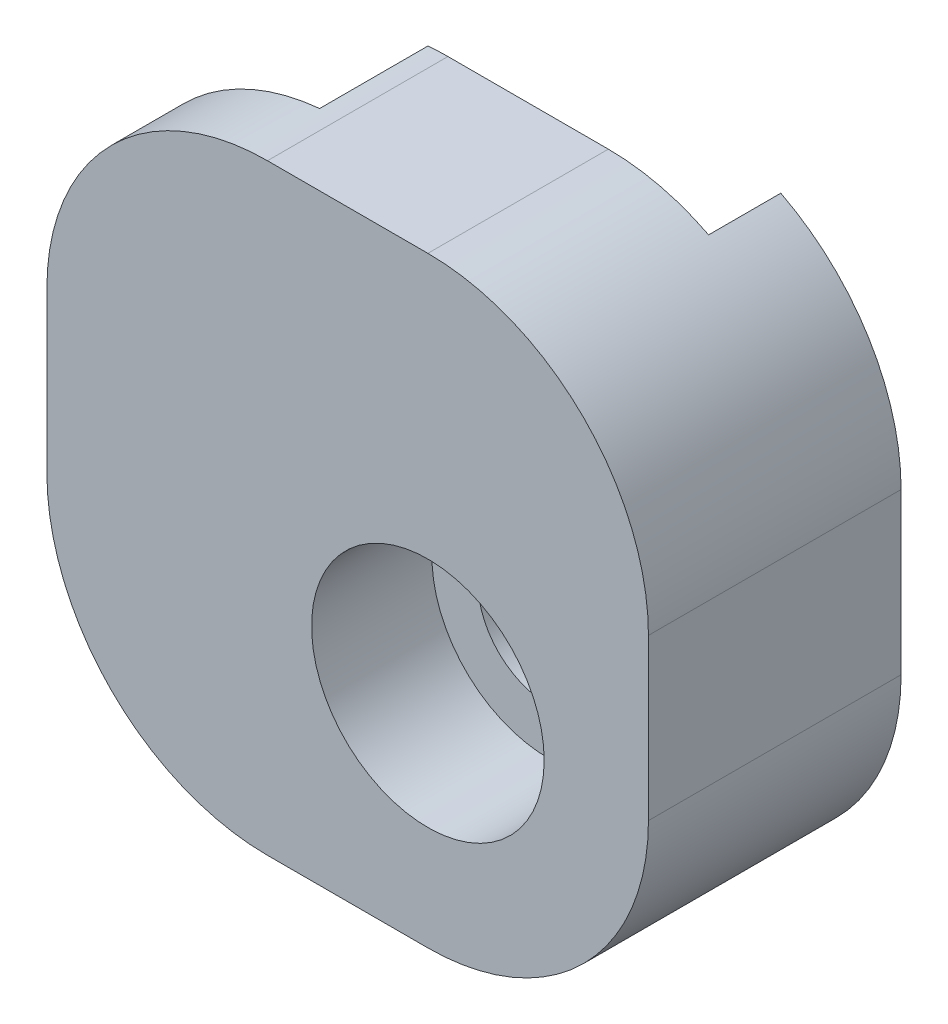
ISO-10303-21;
HEADER;
FILE_DESCRIPTION(('STEP AP214'),'2;1');
FILE_NAME('part.step','',(''),(''),'','','');
FILE_SCHEMA(('AUTOMOTIVE_DESIGN { 1 0 10303 214 1 1 1 1 }'));
ENDSEC;
DATA;
#1=APPLICATION_CONTEXT('core data for automotive mechanical design processes');
#2=APPLICATION_PROTOCOL_DEFINITION('international standard','automotive_design',2000,#1);
#3=PRODUCT_CONTEXT('',#1,'mechanical');
#4=PRODUCT('Part','Part','',(#3));
#5=PRODUCT_RELATED_PRODUCT_CATEGORY('part','',(#4));
#6=PRODUCT_DEFINITION_FORMATION('','',#4);
#7=PRODUCT_DEFINITION_CONTEXT('part definition',#1,'design');
#8=PRODUCT_DEFINITION('design','',#6,#7);
#9=PRODUCT_DEFINITION_SHAPE('','',#8);
#10=(LENGTH_UNIT() NAMED_UNIT(*) SI_UNIT(.MILLI.,.METRE.));
#11=(NAMED_UNIT(*) PLANE_ANGLE_UNIT() SI_UNIT($,.RADIAN.));
#12=(NAMED_UNIT(*) SI_UNIT($,.STERADIAN.) SOLID_ANGLE_UNIT());
#13=UNCERTAINTY_MEASURE_WITH_UNIT(LENGTH_MEASURE(1.E-05),#10,'distance_accuracy_value','');
#14=(GEOMETRIC_REPRESENTATION_CONTEXT(3) GLOBAL_UNCERTAINTY_ASSIGNED_CONTEXT((#13)) GLOBAL_UNIT_ASSIGNED_CONTEXT((#10,
#11,#12)) REPRESENTATION_CONTEXT('',''));
#15=CARTESIAN_POINT('',(0.,0.,0.));
#16=DIRECTION('',(0.,0.,1.));
#17=DIRECTION('',(1.,0.,0.));
#18=AXIS2_PLACEMENT_3D('',#15,#16,#17);
#19=CARTESIAN_POINT('',(-2.5,2.5,2.7));
#20=DIRECTION('',(0.,0.,-1.));
#21=DIRECTION('',(-1.,0.,0.));
#22=AXIS2_PLACEMENT_3D('',#19,#20,#21);
#23=CYLINDRICAL_SURFACE('',#22,1.75);
#24=CARTESIAN_POINT('',(-2.5,2.5,0.));
#25=DIRECTION('',(0.,0.,1.));
#26=DIRECTION('',(1.,0.,0.));
#27=AXIS2_PLACEMENT_3D('',#24,#25,#26);
#28=CIRCLE('',#27,1.75);
#29=CARTESIAN_POINT('',(-0.75,2.5,0.));
#30=VERTEX_POINT('',#29);
#31=EDGE_CURVE('E157',#30,#30,#28,.T.);
#32=ORIENTED_EDGE('',*,*,#31,.F.);
#33=EDGE_LOOP('',(#32));
#34=FACE_BOUND('',#33,.T.);
#35=CARTESIAN_POINT('',(-2.5,2.5,1.5));
#36=DIRECTION('',(0.,0.,1.));
#37=DIRECTION('',(1.,0.,0.));
#38=AXIS2_PLACEMENT_3D('',#35,#36,#37);
#39=CIRCLE('',#38,1.75);
#40=CARTESIAN_POINT('',(-0.75,2.5,1.5));
#41=VERTEX_POINT('',#40);
#42=EDGE_CURVE('E40',#41,#41,#39,.T.);
#43=ORIENTED_EDGE('',*,*,#42,.T.);
#44=EDGE_LOOP('',(#43));
#45=FACE_BOUND('',#44,.T.);
#46=ADVANCED_FACE('F36',(#34,#45),#23,.F.);
#47=CARTESIAN_POINT('',(-12.,0.,0.));
#48=DIRECTION('',(-1.,0.,0.));
#49=DIRECTION('',(0.,0.,1.));
#50=AXIS2_PLACEMENT_3D('',#47,#48,#49);
#51=PLANE('',#50);
#52=DIRECTION('',(0.,0.,1.));
#53=VECTOR('',#52,1.);
#54=CARTESIAN_POINT('',(-12.,2.5,-9.27817459305202));
#55=LINE('',#54,#53);
#56=CARTESIAN_POINT('',(-12.,2.5,2.7));
#57=VERTEX_POINT('',#56);
#58=CARTESIAN_POINT('',(-12.,2.5,4.5));
#59=VERTEX_POINT('',#58);
#60=EDGE_CURVE('E139',#57,#59,#55,.T.);
#61=ORIENTED_EDGE('',*,*,#60,.T.);
#62=DIRECTION('',(0.,-1.,0.));
#63=VECTOR('',#62,1.);
#64=CARTESIAN_POINT('',(-12.,6.5,4.5));
#65=LINE('',#64,#63);
#66=CARTESIAN_POINT('',(-12.,6.5,4.5));
#67=VERTEX_POINT('',#66);
#68=EDGE_CURVE('E52',#67,#59,#65,.T.);
#69=ORIENTED_EDGE('',*,*,#68,.F.);
#70=DIRECTION('',(0.,0.,1.));
#71=VECTOR('',#70,1.);
#72=CARTESIAN_POINT('',(-12.,6.5,-9.27817459305208));
#73=LINE('',#72,#71);
#74=CARTESIAN_POINT('',(-12.,6.5,2.7));
#75=VERTEX_POINT('',#74);
#76=EDGE_CURVE('E11',#67,#75,#73,.F.);
#77=ORIENTED_EDGE('',*,*,#76,.T.);
#78=DIRECTION('',(0.,-1.,0.));
#79=VECTOR('',#78,1.);
#80=CARTESIAN_POINT('',(-12.,12.,2.7));
#81=LINE('',#80,#79);
#82=EDGE_CURVE('E154',#75,#57,#81,.T.);
#83=ORIENTED_EDGE('',*,*,#82,.T.);
#84=EDGE_LOOP('',(#61,#69,#77,#83));
#85=FACE_BOUND('',#84,.T.);
#86=ADVANCED_FACE('F138',(#85),#51,.T.);
#87=CARTESIAN_POINT('',(0.,12.,2.7));
#88=DIRECTION('',(0.,-1.,0.));
#89=DIRECTION('',(0.,0.,-1.));
#90=AXIS2_PLACEMENT_3D('',#87,#88,#89);
#91=PLANE('',#90);
#92=DIRECTION('',(-1.,0.,0.));
#93=VECTOR('',#92,1.);
#94=CARTESIAN_POINT('',(-2.50000000000004,12.,4.5));
#95=LINE('',#94,#93);
#96=CARTESIAN_POINT('',(-2.50000000000004,12.,4.5));
#97=VERTEX_POINT('',#96);
#98=CARTESIAN_POINT('',(-6.5,12.,4.5));
#99=VERTEX_POINT('',#98);
#100=EDGE_CURVE('E133',#97,#99,#95,.T.);
#101=ORIENTED_EDGE('',*,*,#100,.F.);
#102=DIRECTION('',(0.,0.,1.));
#103=VECTOR('',#102,1.);
#104=CARTESIAN_POINT('',(-2.50000000000004,12.,-9.27817459305208));
#105=LINE('',#104,#103);
#106=CARTESIAN_POINT('',(-2.50000000000004,12.,0.));
#107=VERTEX_POINT('',#106);
#108=EDGE_CURVE('E233',#107,#97,#105,.T.);
#109=ORIENTED_EDGE('',*,*,#108,.F.);
#110=DIRECTION('',(-1.,0.,0.));
#111=VECTOR('',#110,1.);
#112=CARTESIAN_POINT('',(0.,12.,0.));
#113=LINE('',#112,#111);
#114=CARTESIAN_POINT('',(-6.5,12.,0.));
#115=VERTEX_POINT('',#114);
#116=EDGE_CURVE('E161',#107,#115,#113,.T.);
#117=ORIENTED_EDGE('',*,*,#116,.T.);
#118=DIRECTION('',(0.,0.,1.));
#119=VECTOR('',#118,1.);
#120=CARTESIAN_POINT('',(-6.5,12.,-9.27817459305208));
#121=LINE('',#120,#119);
#122=EDGE_CURVE('E230',#115,#99,#121,.T.);
#123=ORIENTED_EDGE('',*,*,#122,.T.);
#124=EDGE_LOOP('',(#101,#109,#117,#123));
#125=FACE_BOUND('',#124,.T.);
#126=ADVANCED_FACE('F271',(#125),#91,.F.);
#127=CARTESIAN_POINT('',(0.,-3.,0.));
#128=DIRECTION('',(0.,-1.,0.));
#129=DIRECTION('',(1.,0.,0.));
#130=AXIS2_PLACEMENT_3D('',#127,#128,#129);
#131=PLANE('',#130);
#132=DIRECTION('',(0.,0.,-1.));
#133=VECTOR('',#132,1.);
#134=CARTESIAN_POINT('',(-2.5,-3.,0.));
#135=LINE('',#134,#133);
#136=CARTESIAN_POINT('',(-2.5,-3.,-1.8));
#137=VERTEX_POINT('',#136);
#138=CARTESIAN_POINT('',(-2.5,-3.,4.5));
#139=VERTEX_POINT('',#138);
#140=EDGE_CURVE('E45',#137,#139,#135,.F.);
#141=ORIENTED_EDGE('',*,*,#140,.T.);
#142=DIRECTION('',(1.,0.,0.));
#143=VECTOR('',#142,1.);
#144=CARTESIAN_POINT('',(-6.5,-3.,4.5));
#145=LINE('',#144,#143);
#146=CARTESIAN_POINT('',(-6.5,-3.,4.5));
#147=VERTEX_POINT('',#146);
#148=EDGE_CURVE('E179',#147,#139,#145,.T.);
#149=ORIENTED_EDGE('',*,*,#148,.F.);
#150=DIRECTION('',(0.,0.,1.));
#151=VECTOR('',#150,1.);
#152=CARTESIAN_POINT('',(-6.5,-3.,-9.27817459305202));
#153=LINE('',#152,#151);
#154=CARTESIAN_POINT('',(-6.5,-3.,-1.8));
#155=VERTEX_POINT('',#154);
#156=EDGE_CURVE('E223',#155,#147,#153,.T.);
#157=ORIENTED_EDGE('',*,*,#156,.F.);
#158=DIRECTION('',(-1.,0.,0.));
#159=VECTOR('',#158,1.);
#160=CARTESIAN_POINT('',(-2.5,-3.,-1.8));
#161=LINE('',#160,#159);
#162=EDGE_CURVE('E182',#137,#155,#161,.T.);
#163=ORIENTED_EDGE('',*,*,#162,.F.);
#164=EDGE_LOOP('',(#141,#149,#157,#163));
#165=FACE_BOUND('',#164,.T.);
#166=ADVANCED_FACE('F178',(#165),#131,.T.);
#167=CARTESIAN_POINT('',(3.,0.,0.));
#168=DIRECTION('',(1.,0.,0.));
#169=DIRECTION('',(0.,0.,-1.));
#170=AXIS2_PLACEMENT_3D('',#167,#168,#169);
#171=PLANE('',#170);
#172=DIRECTION('',(0.,0.,1.));
#173=VECTOR('',#172,1.);
#174=CARTESIAN_POINT('',(3.,6.49999999999996,-9.27817459305208));
#175=LINE('',#174,#173);
#176=CARTESIAN_POINT('',(3.,6.49999999999997,-1.8));
#177=VERTEX_POINT('',#176);
#178=CARTESIAN_POINT('',(3.,6.49999999999996,4.5));
#179=VERTEX_POINT('',#178);
#180=EDGE_CURVE('E229',#177,#179,#175,.T.);
#181=ORIENTED_EDGE('',*,*,#180,.T.);
#182=DIRECTION('',(0.,1.,0.));
#183=VECTOR('',#182,1.);
#184=CARTESIAN_POINT('',(3.,2.5,4.5));
#185=LINE('',#184,#183);
#186=CARTESIAN_POINT('',(3.,2.5,4.5));
#187=VERTEX_POINT('',#186);
#188=EDGE_CURVE('E191',#187,#179,#185,.T.);
#189=ORIENTED_EDGE('',*,*,#188,.F.);
#190=DIRECTION('',(0.,0.,-1.));
#191=VECTOR('',#190,1.);
#192=CARTESIAN_POINT('',(3.,2.5,0.));
#193=LINE('',#192,#191);
#194=CARTESIAN_POINT('',(3.,2.5,-1.8));
#195=VERTEX_POINT('',#194);
#196=EDGE_CURVE('E172',#187,#195,#193,.T.);
#197=ORIENTED_EDGE('',*,*,#196,.T.);
#198=DIRECTION('',(0.,-1.,0.));
#199=VECTOR('',#198,1.);
#200=CARTESIAN_POINT('',(3.,6.49999999999996,-1.8));
#201=LINE('',#200,#199);
#202=EDGE_CURVE('E220',#177,#195,#201,.T.);
#203=ORIENTED_EDGE('',*,*,#202,.F.);
#204=EDGE_LOOP('',(#181,#189,#197,#203));
#205=FACE_BOUND('',#204,.T.);
#206=ADVANCED_FACE('F283',(#205),#171,.T.);
#207=CARTESIAN_POINT('',(-2.5,2.5,1.8));
#208=DIRECTION('',(0.,0.,1.));
#209=DIRECTION('',(1.,0.,0.));
#210=AXIS2_PLACEMENT_3D('',#207,#208,#209);
#211=CYLINDRICAL_SURFACE('',#210,2.9);
#212=CARTESIAN_POINT('',(-2.5,2.5,4.5));
#213=DIRECTION('',(0.,0.,1.));
#214=DIRECTION('',(1.,0.,0.));
#215=AXIS2_PLACEMENT_3D('',#212,#213,#214);
#216=CIRCLE('',#215,2.9);
#217=CARTESIAN_POINT('',(0.4,2.5,4.5));
#218=VERTEX_POINT('',#217);
#219=EDGE_CURVE('E200',#218,#218,#216,.F.);
#220=ORIENTED_EDGE('',*,*,#219,.F.);
#221=EDGE_LOOP('',(#220));
#222=FACE_BOUND('',#221,.T.);
#223=CARTESIAN_POINT('',(-2.5,2.5,1.5));
#224=DIRECTION('',(0.,0.,1.));
#225=DIRECTION('',(1.,0.,0.));
#226=AXIS2_PLACEMENT_3D('',#223,#224,#225);
#227=CIRCLE('',#226,2.9);
#228=CARTESIAN_POINT('',(0.4,2.5,1.5));
#229=VERTEX_POINT('',#228);
#230=EDGE_CURVE('E497',#229,#229,#227,.T.);
#231=ORIENTED_EDGE('',*,*,#230,.F.);
#232=EDGE_LOOP('',(#231));
#233=FACE_BOUND('',#232,.T.);
#234=ADVANCED_FACE('F285',(#222,#233),#211,.F.);
#235=CARTESIAN_POINT('',(-2.5,2.5,0.));
#236=DIRECTION('',(0.,0.,-1.));
#237=DIRECTION('',(-1.,0.,0.));
#238=AXIS2_PLACEMENT_3D('',#235,#236,#237);
#239=CYLINDRICAL_SURFACE('',#238,5.5);
#240=ORIENTED_EDGE('',*,*,#196,.F.);
#241=CARTESIAN_POINT('',(-2.5,2.5,4.5));
#242=DIRECTION('',(0.,0.,1.));
#243=DIRECTION('',(1.,0.,0.));
#244=AXIS2_PLACEMENT_3D('',#241,#242,#243);
#245=CIRCLE('',#244,5.5);
#246=EDGE_CURVE('E189',#139,#187,#245,.T.);
#247=ORIENTED_EDGE('',*,*,#246,.F.);
#248=ORIENTED_EDGE('',*,*,#140,.F.);
#249=CARTESIAN_POINT('',(-2.5,2.5,-1.8));
#250=DIRECTION('',(0.,0.,-1.));
#251=DIRECTION('',(-1.,0.,0.));
#252=AXIS2_PLACEMENT_3D('',#249,#250,#251);
#253=CIRCLE('',#252,5.5);
#254=EDGE_CURVE('E188',#195,#137,#253,.T.);
#255=ORIENTED_EDGE('',*,*,#254,.F.);
#256=EDGE_LOOP('',(#240,#247,#248,#255));
#257=FACE_BOUND('',#256,.T.);
#258=ADVANCED_FACE('F38',(#257),#239,.T.);
#259=CARTESIAN_POINT('',(-2.5,6.5,-9.27817459305208));
#260=DIRECTION('',(0.,0.,1.));
#261=DIRECTION('',(1.,0.,0.));
#262=AXIS2_PLACEMENT_3D('',#259,#260,#261);
#263=CYLINDRICAL_SURFACE('',#262,5.5);
#264=CARTESIAN_POINT('',(-2.5,6.5,4.5));
#265=DIRECTION('',(0.,0.,1.));
#266=DIRECTION('',(1.,0.,0.));
#267=AXIS2_PLACEMENT_3D('',#264,#265,#266);
#268=CIRCLE('',#267,5.5);
#269=EDGE_CURVE('E193',#179,#97,#268,.T.);
#270=ORIENTED_EDGE('',*,*,#269,.F.);
#271=ORIENTED_EDGE('',*,*,#180,.F.);
#272=CARTESIAN_POINT('',(-2.5,6.5,-1.8));
#273=DIRECTION('',(0.,0.,-1.));
#274=DIRECTION('',(-1.,0.,0.));
#275=AXIS2_PLACEMENT_3D('',#272,#273,#274);
#276=CIRCLE('',#275,5.5);
#277=CARTESIAN_POINT('',(0.,11.3989794855664,-1.8));
#278=VERTEX_POINT('',#277);
#279=EDGE_CURVE('E217',#278,#177,#276,.T.);
#280=ORIENTED_EDGE('',*,*,#279,.F.);
#281=DIRECTION('',(0.,0.,1.));
#282=VECTOR('',#281,1.);
#283=CARTESIAN_POINT('',(0.,11.3989794855664,-9.27817459305208));
#284=LINE('',#283,#282);
#285=CARTESIAN_POINT('',(0.,11.3989794855664,0.));
#286=VERTEX_POINT('',#285);
#287=EDGE_CURVE('E232',#286,#278,#284,.F.);
#288=ORIENTED_EDGE('',*,*,#287,.F.);
#289=CARTESIAN_POINT('',(-2.5,6.5,0.));
#290=DIRECTION('',(0.,0.,1.));
#291=DIRECTION('',(1.,0.,0.));
#292=AXIS2_PLACEMENT_3D('',#289,#290,#291);
#293=CIRCLE('',#292,5.5);
#294=EDGE_CURVE('E151',#107,#286,#293,.F.);
#295=ORIENTED_EDGE('',*,*,#294,.F.);
#296=ORIENTED_EDGE('',*,*,#108,.T.);
#297=EDGE_LOOP('',(#270,#271,#280,#288,#295,#296));
#298=FACE_BOUND('',#297,.T.);
#299=ADVANCED_FACE('F268',(#298),#263,.T.);
#300=CARTESIAN_POINT('',(-6.5,6.5,-9.27817459305208));
#301=DIRECTION('',(0.,0.,1.));
#302=DIRECTION('',(1.,0.,0.));
#303=AXIS2_PLACEMENT_3D('',#300,#301,#302);
#304=CYLINDRICAL_SURFACE('',#303,5.5);
#305=CARTESIAN_POINT('',(-6.5,6.5,4.5));
#306=DIRECTION('',(0.,0.,1.));
#307=DIRECTION('',(1.,0.,0.));
#308=AXIS2_PLACEMENT_3D('',#305,#306,#307);
#309=CIRCLE('',#308,5.5);
#310=EDGE_CURVE('E129',#99,#67,#309,.T.);
#311=ORIENTED_EDGE('',*,*,#310,.F.);
#312=ORIENTED_EDGE('',*,*,#122,.F.);
#313=CARTESIAN_POINT('',(-6.5,6.5,0.));
#314=DIRECTION('',(0.,0.,1.));
#315=DIRECTION('',(1.,0.,0.));
#316=AXIS2_PLACEMENT_3D('',#313,#314,#315);
#317=CIRCLE('',#316,5.5);
#318=CARTESIAN_POINT('',(-7.,11.9772255750517,0.));
#319=VERTEX_POINT('',#318);
#320=EDGE_CURVE('E242',#319,#115,#317,.F.);
#321=ORIENTED_EDGE('',*,*,#320,.F.);
#322=DIRECTION('',(0.,0.,1.));
#323=VECTOR('',#322,1.);
#324=CARTESIAN_POINT('',(-7.,11.9772255750517,-9.27817459305208));
#325=LINE('',#324,#323);
#326=CARTESIAN_POINT('',(-7.,11.9772255750517,2.7));
#327=VERTEX_POINT('',#326);
#328=EDGE_CURVE('E147',#327,#319,#325,.F.);
#329=ORIENTED_EDGE('',*,*,#328,.F.);
#330=CARTESIAN_POINT('',(-6.5,6.5,2.7));
#331=DIRECTION('',(0.,0.,1.));
#332=DIRECTION('',(0.,-1.,0.));
#333=AXIS2_PLACEMENT_3D('',#330,#331,#332);
#334=CIRCLE('',#333,5.5);
#335=EDGE_CURVE('E144',#75,#327,#334,.F.);
#336=ORIENTED_EDGE('',*,*,#335,.F.);
#337=ORIENTED_EDGE('',*,*,#76,.F.);
#338=EDGE_LOOP('',(#311,#312,#321,#329,#336,#337));
#339=FACE_BOUND('',#338,.T.);
#340=ADVANCED_FACE('F142',(#339),#304,.T.);
#341=CARTESIAN_POINT('',(-6.5,2.5,-9.27817459305202));
#342=DIRECTION('',(0.,0.,1.));
#343=DIRECTION('',(1.,0.,0.));
#344=AXIS2_PLACEMENT_3D('',#341,#342,#343);
#345=CYLINDRICAL_SURFACE('',#344,5.5);
#346=ORIENTED_EDGE('',*,*,#156,.T.);
#347=CARTESIAN_POINT('',(-6.5,2.5,4.5));
#348=DIRECTION('',(0.,0.,1.));
#349=DIRECTION('',(1.,0.,0.));
#350=AXIS2_PLACEMENT_3D('',#347,#348,#349);
#351=CIRCLE('',#350,5.5);
#352=EDGE_CURVE('E140',#59,#147,#351,.T.);
#353=ORIENTED_EDGE('',*,*,#352,.F.);
#354=ORIENTED_EDGE('',*,*,#60,.F.);
#355=CARTESIAN_POINT('',(-6.5,2.5,2.7));
#356=DIRECTION('',(0.,0.,1.));
#357=DIRECTION('',(0.,-1.,0.));
#358=AXIS2_PLACEMENT_3D('',#355,#356,#357);
#359=CIRCLE('',#358,5.5);
#360=CARTESIAN_POINT('',(-7.,-2.97722557505166,2.7));
#361=VERTEX_POINT('',#360);
#362=EDGE_CURVE('E156',#57,#361,#359,.T.);
#363=ORIENTED_EDGE('',*,*,#362,.T.);
#364=DIRECTION('',(0.,0.,1.));
#365=VECTOR('',#364,1.);
#366=CARTESIAN_POINT('',(-7.,-2.97722557505166,-9.27817459305202));
#367=LINE('',#366,#365);
#368=CARTESIAN_POINT('',(-7.,-2.97722557505166,-1.8));
#369=VERTEX_POINT('',#368);
#370=EDGE_CURVE('E227',#361,#369,#367,.F.);
#371=ORIENTED_EDGE('',*,*,#370,.T.);
#372=CARTESIAN_POINT('',(-6.5,2.5,-1.8));
#373=DIRECTION('',(0.,0.,-1.));
#374=DIRECTION('',(-1.,0.,0.));
#375=AXIS2_PLACEMENT_3D('',#372,#373,#374);
#376=CIRCLE('',#375,5.5);
#377=EDGE_CURVE('E205',#155,#369,#376,.T.);
#378=ORIENTED_EDGE('',*,*,#377,.F.);
#379=EDGE_LOOP('',(#346,#353,#354,#363,#371,#378));
#380=FACE_BOUND('',#379,.T.);
#381=ADVANCED_FACE('F278',(#380),#345,.T.);
#382=CARTESIAN_POINT('',(-7.,0.,2.7));
#383=DIRECTION('',(1.,0.,0.));
#384=DIRECTION('',(0.,0.,-1.));
#385=AXIS2_PLACEMENT_3D('',#382,#383,#384);
#386=PLANE('',#385);
#387=ORIENTED_EDGE('',*,*,#370,.F.);
#388=DIRECTION('',(0.,-1.,0.));
#389=VECTOR('',#388,1.);
#390=CARTESIAN_POINT('',(-7.,12.,2.7));
#391=LINE('',#390,#389);
#392=EDGE_CURVE('E158',#327,#361,#391,.T.);
#393=ORIENTED_EDGE('',*,*,#392,.F.);
#394=ORIENTED_EDGE('',*,*,#328,.T.);
#395=DIRECTION('',(0.,-1.,0.));
#396=VECTOR('',#395,1.);
#397=CARTESIAN_POINT('',(-7.,0.,0.));
#398=LINE('',#397,#396);
#399=CARTESIAN_POINT('',(-7.,0.,0.));
#400=VERTEX_POINT('',#399);
#401=EDGE_CURVE('E170',#319,#400,#398,.T.);
#402=ORIENTED_EDGE('',*,*,#401,.T.);
#403=DIRECTION('',(0.,0.,1.));
#404=VECTOR('',#403,1.);
#405=CARTESIAN_POINT('',(-7.,0.,-1.5));
#406=LINE('',#405,#404);
#407=CARTESIAN_POINT('',(-7.,0.,-1.8));
#408=VERTEX_POINT('',#407);
#409=EDGE_CURVE('E250',#408,#400,#406,.T.);
#410=ORIENTED_EDGE('',*,*,#409,.F.);
#411=DIRECTION('',(0.,1.,0.));
#412=VECTOR('',#411,1.);
#413=CARTESIAN_POINT('',(-7.,-2.97722557505166,-1.8));
#414=LINE('',#413,#412);
#415=EDGE_CURVE('E208',#369,#408,#414,.T.);
#416=ORIENTED_EDGE('',*,*,#415,.F.);
#417=EDGE_LOOP('',(#387,#393,#394,#402,#410,#416));
#418=FACE_BOUND('',#417,.T.);
#419=ADVANCED_FACE('F274',(#418),#386,.F.);
#420=CARTESIAN_POINT('',(-12.,12.,2.7));
#421=DIRECTION('',(0.,0.,1.));
#422=DIRECTION('',(0.,-1.,0.));
#423=AXIS2_PLACEMENT_3D('',#420,#421,#422);
#424=PLANE('',#423);
#425=ORIENTED_EDGE('',*,*,#362,.F.);
#426=ORIENTED_EDGE('',*,*,#82,.F.);
#427=ORIENTED_EDGE('',*,*,#335,.T.);
#428=ORIENTED_EDGE('',*,*,#392,.T.);
#429=EDGE_LOOP('',(#425,#426,#427,#428));
#430=FACE_BOUND('',#429,.T.);
#431=ADVANCED_FACE('F155',(#430),#424,.F.);
#432=CARTESIAN_POINT('',(0.,0.,0.));
#433=DIRECTION('',(0.,0.,1.));
#434=DIRECTION('',(1.,0.,0.));
#435=AXIS2_PLACEMENT_3D('',#432,#433,#434);
#436=PLANE('',#435);
#437=ORIENTED_EDGE('',*,*,#401,.F.);
#438=ORIENTED_EDGE('',*,*,#320,.T.);
#439=ORIENTED_EDGE('',*,*,#116,.F.);
#440=ORIENTED_EDGE('',*,*,#294,.T.);
#441=DIRECTION('',(0.,1.,0.));
#442=VECTOR('',#441,1.);
#443=CARTESIAN_POINT('',(0.,0.,0.));
#444=LINE('',#443,#442);
#445=CARTESIAN_POINT('',(0.,0.,0.));
#446=VERTEX_POINT('',#445);
#447=EDGE_CURVE('E248',#446,#286,#444,.T.);
#448=ORIENTED_EDGE('',*,*,#447,.F.);
#449=DIRECTION('',(-1.,0.,0.));
#450=VECTOR('',#449,1.);
#451=CARTESIAN_POINT('',(0.,0.,0.));
#452=LINE('',#451,#450);
#453=EDGE_CURVE('E245',#446,#400,#452,.T.);
#454=ORIENTED_EDGE('',*,*,#453,.T.);
#455=EDGE_LOOP('',(#437,#438,#439,#440,#448,#454));
#456=FACE_BOUND('',#455,.T.);
#457=ORIENTED_EDGE('',*,*,#31,.T.);
#458=EDGE_LOOP('',(#457));
#459=FACE_BOUND('',#458,.T.);
#460=ADVANCED_FACE('F262',(#456,#459),#436,.F.);
#461=CARTESIAN_POINT('',(0.,0.,-1.5));
#462=DIRECTION('',(0.,1.,0.));
#463=DIRECTION('',(0.,0.,1.));
#464=AXIS2_PLACEMENT_3D('',#461,#462,#463);
#465=PLANE('',#464);
#466=ORIENTED_EDGE('',*,*,#453,.F.);
#467=DIRECTION('',(0.,0.,1.));
#468=VECTOR('',#467,1.);
#469=CARTESIAN_POINT('',(0.,0.,-1.5));
#470=LINE('',#469,#468);
#471=CARTESIAN_POINT('',(0.,0.,-1.8));
#472=VERTEX_POINT('',#471);
#473=EDGE_CURVE('E163',#472,#446,#470,.T.);
#474=ORIENTED_EDGE('',*,*,#473,.F.);
#475=DIRECTION('',(1.,0.,0.));
#476=VECTOR('',#475,1.);
#477=CARTESIAN_POINT('',(-7.,0.,-1.8));
#478=LINE('',#477,#476);
#479=EDGE_CURVE('E211',#408,#472,#478,.T.);
#480=ORIENTED_EDGE('',*,*,#479,.F.);
#481=ORIENTED_EDGE('',*,*,#409,.T.);
#482=EDGE_LOOP('',(#466,#474,#480,#481));
#483=FACE_BOUND('',#482,.T.);
#484=ADVANCED_FACE('F259',(#483),#465,.T.);
#485=CARTESIAN_POINT('',(0.,0.,-1.5));
#486=DIRECTION('',(1.,0.,0.));
#487=DIRECTION('',(0.,0.,-1.));
#488=AXIS2_PLACEMENT_3D('',#485,#486,#487);
#489=PLANE('',#488);
#490=ORIENTED_EDGE('',*,*,#447,.T.);
#491=ORIENTED_EDGE('',*,*,#287,.T.);
#492=DIRECTION('',(0.,1.,0.));
#493=VECTOR('',#492,1.);
#494=CARTESIAN_POINT('',(0.,0.,-1.8));
#495=LINE('',#494,#493);
#496=EDGE_CURVE('E214',#472,#278,#495,.T.);
#497=ORIENTED_EDGE('',*,*,#496,.F.);
#498=ORIENTED_EDGE('',*,*,#473,.T.);
#499=EDGE_LOOP('',(#490,#491,#497,#498));
#500=FACE_BOUND('',#499,.T.);
#501=ADVANCED_FACE('F258',(#500),#489,.F.);
#502=CARTESIAN_POINT('',(-2.5,2.5,-1.8));
#503=DIRECTION('',(0.,0.,-1.));
#504=DIRECTION('',(-1.,0.,0.));
#505=AXIS2_PLACEMENT_3D('',#502,#503,#504);
#506=PLANE('',#505);
#507=ORIENTED_EDGE('',*,*,#254,.T.);
#508=ORIENTED_EDGE('',*,*,#162,.T.);
#509=ORIENTED_EDGE('',*,*,#377,.T.);
#510=ORIENTED_EDGE('',*,*,#415,.T.);
#511=ORIENTED_EDGE('',*,*,#479,.T.);
#512=ORIENTED_EDGE('',*,*,#496,.T.);
#513=ORIENTED_EDGE('',*,*,#279,.T.);
#514=ORIENTED_EDGE('',*,*,#202,.T.);
#515=EDGE_LOOP('',(#507,#508,#509,#510,#511,#512,#513,#514));
#516=FACE_BOUND('',#515,.T.);
#517=ADVANCED_FACE('F280',(#516),#506,.T.);
#518=CARTESIAN_POINT('',(-6.5,6.5,4.5));
#519=DIRECTION('',(0.,0.,1.));
#520=DIRECTION('',(1.,0.,0.));
#521=AXIS2_PLACEMENT_3D('',#518,#519,#520);
#522=PLANE('',#521);
#523=ORIENTED_EDGE('',*,*,#310,.T.);
#524=ORIENTED_EDGE('',*,*,#68,.T.);
#525=ORIENTED_EDGE('',*,*,#352,.T.);
#526=ORIENTED_EDGE('',*,*,#148,.T.);
#527=ORIENTED_EDGE('',*,*,#246,.T.);
#528=ORIENTED_EDGE('',*,*,#188,.T.);
#529=ORIENTED_EDGE('',*,*,#269,.T.);
#530=ORIENTED_EDGE('',*,*,#100,.T.);
#531=EDGE_LOOP('',(#523,#524,#525,#526,#527,#528,#529,#530));
#532=FACE_BOUND('',#531,.T.);
#533=ORIENTED_EDGE('',*,*,#219,.T.);
#534=EDGE_LOOP('',(#533));
#535=FACE_BOUND('',#534,.T.);
#536=ADVANCED_FACE('F130',(#532,#535),#522,.T.);
#537=CARTESIAN_POINT('',(-2.5,2.5,1.5));
#538=DIRECTION('',(0.,0.,1.));
#539=DIRECTION('',(1.,0.,0.));
#540=AXIS2_PLACEMENT_3D('',#537,#538,#539);
#541=PLANE('',#540);
#542=ORIENTED_EDGE('',*,*,#42,.F.);
#543=EDGE_LOOP('',(#542));
#544=FACE_BOUND('',#543,.T.);
#545=ORIENTED_EDGE('',*,*,#230,.T.);
#546=EDGE_LOOP('',(#545));
#547=FACE_BOUND('',#546,.T.);
#548=ADVANCED_FACE('F369',(#544,#547),#541,.T.);
#549=CLOSED_SHELL('',(#46,#86,#126,#166,#206,#234,#258,#299,#340,#381,#419,#431,#460,#484,#501,
#517,#536,#548));
#550=MANIFOLD_SOLID_BREP('B2',#549);
#551=ADVANCED_BREP_SHAPE_REPRESENTATION('',(#18,#550),#14);
#552=SHAPE_DEFINITION_REPRESENTATION(#9,#551);
ENDSEC;
END-ISO-10303-21;
